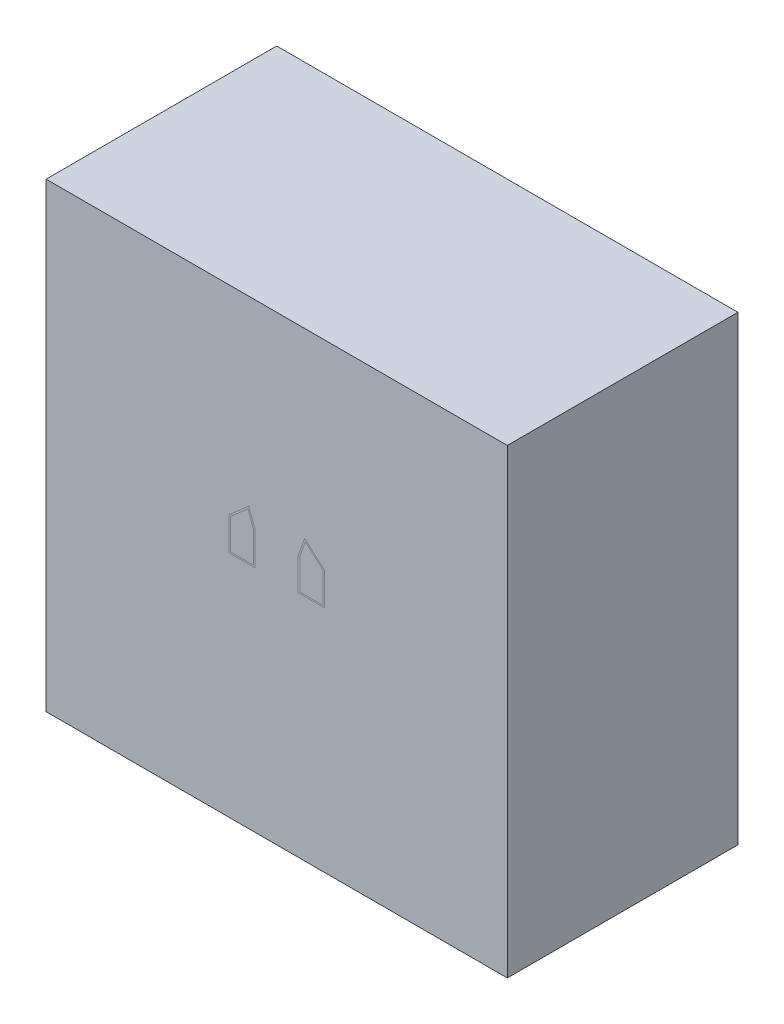
ISO-10303-21;
HEADER;
FILE_DESCRIPTION(('STEP AP214'),'2;1');
FILE_NAME('part.step','',(''),(''),'','','');
FILE_SCHEMA(('AUTOMOTIVE_DESIGN { 1 0 10303 214 1 1 1 1 }'));
ENDSEC;
DATA;
#1=APPLICATION_CONTEXT('core data for automotive mechanical design processes');
#2=APPLICATION_PROTOCOL_DEFINITION('international standard','automotive_design',2000,#1);
#3=PRODUCT_CONTEXT('',#1,'mechanical');
#4=PRODUCT('Part','Part','',(#3));
#5=PRODUCT_RELATED_PRODUCT_CATEGORY('part','',(#4));
#6=PRODUCT_DEFINITION_FORMATION('','',#4);
#7=PRODUCT_DEFINITION_CONTEXT('part definition',#1,'design');
#8=PRODUCT_DEFINITION('design','',#6,#7);
#9=PRODUCT_DEFINITION_SHAPE('','',#8);
#10=(LENGTH_UNIT() NAMED_UNIT(*) SI_UNIT(.MILLI.,.METRE.));
#11=(NAMED_UNIT(*) PLANE_ANGLE_UNIT() SI_UNIT($,.RADIAN.));
#12=(NAMED_UNIT(*) SI_UNIT($,.STERADIAN.) SOLID_ANGLE_UNIT());
#13=UNCERTAINTY_MEASURE_WITH_UNIT(LENGTH_MEASURE(1.E-05),#10,'distance_accuracy_value','');
#14=(GEOMETRIC_REPRESENTATION_CONTEXT(3) GLOBAL_UNCERTAINTY_ASSIGNED_CONTEXT((#13)) GLOBAL_UNIT_ASSIGNED_CONTEXT((#10,
#11,#12)) REPRESENTATION_CONTEXT('',''));
#15=CARTESIAN_POINT('',(0.,0.,0.));
#16=DIRECTION('',(0.,0.,1.));
#17=DIRECTION('',(1.,0.,0.));
#18=AXIS2_PLACEMENT_3D('',#15,#16,#17);
#19=CARTESIAN_POINT('',(0.,201.763269807085,0.));
#20=DIRECTION('',(0.,1.,0.));
#21=DIRECTION('',(0.,0.,1.));
#22=AXIS2_PLACEMENT_3D('',#19,#20,#21);
#23=CONICAL_SURFACE('',#22,140.,0.349065850398862);
#24=DIRECTION('',(-0.342020143325665,0.93969262078591,0.));
#25=VECTOR('',#24,1.);
#26=CARTESIAN_POINT('',(0.,-182.883568916567,0.));
#27=LINE('',#26,#25);
#28=CARTESIAN_POINT('',(-182.009803830833,317.184257228019,0.));
#29=VERTEX_POINT('',#28);
#30=CARTESIAN_POINT('',(-140.,201.763269807085,0.));
#31=VERTEX_POINT('',#30);
#32=EDGE_CURVE('E77',#29,#31,#27,.F.);
#33=ORIENTED_EDGE('',*,*,#32,.F.);
#34=CARTESIAN_POINT('',(0.,317.184257228019,0.));
#35=DIRECTION('',(0.,-1.,0.));
#36=DIRECTION('',(0.,0.,-1.));
#37=AXIS2_PLACEMENT_3D('',#34,#35,#36);
#38=CIRCLE('',#37,182.009803830833);
#39=CARTESIAN_POINT('',(182.009803830833,317.184257228019,0.));
#40=VERTEX_POINT('',#39);
#41=EDGE_CURVE('E176',#29,#40,#38,.T.);
#42=ORIENTED_EDGE('',*,*,#41,.T.);
#43=DIRECTION('',(-0.342020143325665,-0.93969262078591,0.));
#44=VECTOR('',#43,1.);
#45=CARTESIAN_POINT('',(0.,-182.883568916567,0.));
#46=LINE('',#45,#44);
#47=CARTESIAN_POINT('',(140.,201.763269807085,0.));
#48=VERTEX_POINT('',#47);
#49=EDGE_CURVE('E152',#48,#40,#46,.F.);
#50=ORIENTED_EDGE('',*,*,#49,.F.);
#51=CARTESIAN_POINT('',(0.,201.763269807085,0.));
#52=DIRECTION('',(0.,-1.,0.));
#53=DIRECTION('',(0.,0.,-1.));
#54=AXIS2_PLACEMENT_3D('',#51,#52,#53);
#55=CIRCLE('',#54,140.);
#56=EDGE_CURVE('E172',#31,#48,#55,.T.);
#57=ORIENTED_EDGE('',*,*,#56,.F.);
#58=EDGE_LOOP('',(#33,#42,#50,#57));
#59=FACE_BOUND('',#58,.T.);
#60=ADVANCED_FACE('F54',(#59),#23,.T.);
#61=CARTESIAN_POINT('',(0.,204.519783083283,0.));
#62=DIRECTION('',(0.,-1.,0.));
#63=DIRECTION('',(0.,0.,-1.));
#64=AXIS2_PLACEMENT_3D('',#61,#62,#63);
#65=CONICAL_SURFACE('',#64,310.,0.848995740903218);
#66=CARTESIAN_POINT('',(0.,204.519783083283,0.));
#67=DIRECTION('',(0.,-1.,0.));
#68=DIRECTION('',(0.,0.,-1.));
#69=AXIS2_PLACEMENT_3D('',#66,#67,#68);
#70=CIRCLE('',#69,310.);
#71=CARTESIAN_POINT('',(-310.,204.519783083283,0.));
#72=VERTEX_POINT('',#71);
#73=CARTESIAN_POINT('',(310.,204.519783083283,0.));
#74=VERTEX_POINT('',#73);
#75=EDGE_CURVE('E180',#72,#74,#70,.T.);
#76=ORIENTED_EDGE('',*,*,#75,.T.);
#77=DIRECTION('',(0.750617232326963,-0.660737293130795,0.));
#78=VECTOR('',#77,1.);
#79=CARTESIAN_POINT('',(0.,477.399956957741,0.));
#80=LINE('',#79,#78);
#81=EDGE_CURVE('E213',#74,#40,#80,.F.);
#82=ORIENTED_EDGE('',*,*,#81,.T.);
#83=ORIENTED_EDGE('',*,*,#41,.F.);
#84=DIRECTION('',(0.750617232326963,0.660737293130795,0.));
#85=VECTOR('',#84,1.);
#86=CARTESIAN_POINT('',(0.,477.399956957741,0.));
#87=LINE('',#86,#85);
#88=EDGE_CURVE('E222',#29,#72,#87,.F.);
#89=ORIENTED_EDGE('',*,*,#88,.T.);
#90=EDGE_LOOP('',(#76,#82,#83,#89));
#91=FACE_BOUND('',#90,.T.);
#92=ADVANCED_FACE('F249',(#91),#65,.F.);
#93=CARTESIAN_POINT('',(0.,0.,0.));
#94=DIRECTION('',(0.,-1.,0.));
#95=DIRECTION('',(0.,0.,-1.));
#96=AXIS2_PLACEMENT_3D('',#93,#94,#95);
#97=CYLINDRICAL_SURFACE('',#96,310.);
#98=DIRECTION('',(0.,-1.,0.));
#99=VECTOR('',#98,1.);
#100=CARTESIAN_POINT('',(310.,0.,0.));
#101=LINE('',#100,#99);
#102=CARTESIAN_POINT('',(310.,-10.,0.));
#103=VERTEX_POINT('',#102);
#104=EDGE_CURVE('E215',#74,#103,#101,.T.);
#105=ORIENTED_EDGE('',*,*,#104,.F.);
#106=ORIENTED_EDGE('',*,*,#75,.F.);
#107=DIRECTION('',(0.,-1.,0.));
#108=VECTOR('',#107,1.);
#109=CARTESIAN_POINT('',(-310.,0.,0.));
#110=LINE('',#109,#108);
#111=CARTESIAN_POINT('',(-310.,-10.,0.));
#112=VERTEX_POINT('',#111);
#113=EDGE_CURVE('E202',#112,#72,#110,.F.);
#114=ORIENTED_EDGE('',*,*,#113,.F.);
#115=CARTESIAN_POINT('',(0.,-10.,0.));
#116=DIRECTION('',(0.,-1.,0.));
#117=DIRECTION('',(0.,0.,-1.));
#118=AXIS2_PLACEMENT_3D('',#115,#116,#117);
#119=CIRCLE('',#118,310.);
#120=EDGE_CURVE('E184',#112,#103,#119,.T.);
#121=ORIENTED_EDGE('',*,*,#120,.T.);
#122=EDGE_LOOP('',(#105,#106,#114,#121));
#123=FACE_BOUND('',#122,.T.);
#124=ADVANCED_FACE('F253',(#123),#97,.F.);
#125=CARTESIAN_POINT('',(300.,-10.,0.));
#126=DIRECTION('',(0.,1.,0.));
#127=DIRECTION('',(0.,0.,1.));
#128=AXIS2_PLACEMENT_3D('',#125,#126,#127);
#129=PLANE('',#128);
#130=DIRECTION('',(-1.,0.,0.));
#131=VECTOR('',#130,1.);
#132=CARTESIAN_POINT('',(300.,-10.,0.));
#133=LINE('',#132,#131);
#134=CARTESIAN_POINT('',(140.,-10.,0.));
#135=VERTEX_POINT('',#134);
#136=EDGE_CURVE('E204',#103,#135,#133,.T.);
#137=ORIENTED_EDGE('',*,*,#136,.F.);
#138=ORIENTED_EDGE('',*,*,#120,.F.);
#139=CARTESIAN_POINT('',(-140.,-10.,0.));
#140=VERTEX_POINT('',#139);
#141=EDGE_CURVE('E192',#140,#112,#133,.T.);
#142=ORIENTED_EDGE('',*,*,#141,.F.);
#143=CARTESIAN_POINT('',(0.,-10.,0.));
#144=DIRECTION('',(0.,-1.,0.));
#145=DIRECTION('',(0.,0.,-1.));
#146=AXIS2_PLACEMENT_3D('',#143,#144,#145);
#147=CIRCLE('',#146,140.);
#148=EDGE_CURVE('E171',#140,#135,#147,.T.);
#149=ORIENTED_EDGE('',*,*,#148,.T.);
#150=EDGE_LOOP('',(#137,#138,#142,#149));
#151=FACE_BOUND('',#150,.T.);
#152=ADVANCED_FACE('F200',(#151),#129,.T.);
#153=CARTESIAN_POINT('',(0.,0.,0.));
#154=DIRECTION('',(0.,-1.,0.));
#155=DIRECTION('',(0.,0.,-1.));
#156=AXIS2_PLACEMENT_3D('',#153,#154,#155);
#157=CYLINDRICAL_SURFACE('',#156,140.);
#158=DIRECTION('',(0.,-1.,0.));
#159=VECTOR('',#158,1.);
#160=CARTESIAN_POINT('',(140.,0.,0.));
#161=LINE('',#160,#159);
#162=EDGE_CURVE('E12',#135,#48,#161,.F.);
#163=ORIENTED_EDGE('',*,*,#162,.F.);
#164=ORIENTED_EDGE('',*,*,#148,.F.);
#165=DIRECTION('',(0.,-1.,0.));
#166=VECTOR('',#165,1.);
#167=CARTESIAN_POINT('',(-140.,0.,0.));
#168=LINE('',#167,#166);
#169=EDGE_CURVE('E62',#31,#140,#168,.T.);
#170=ORIENTED_EDGE('',*,*,#169,.F.);
#171=ORIENTED_EDGE('',*,*,#56,.T.);
#172=EDGE_LOOP('',(#163,#164,#170,#171));
#173=FACE_BOUND('',#172,.T.);
#174=ADVANCED_FACE('F206',(#173),#157,.T.);
#175=CARTESIAN_POINT('',(-1500.,-1500.,0.));
#176=DIRECTION('',(0.,0.,-1.));
#177=DIRECTION('',(-1.,0.,0.));
#178=AXIS2_PLACEMENT_3D('',#175,#176,#177);
#179=PLANE('',#178);
#180=ORIENTED_EDGE('',*,*,#49,.T.);
#181=ORIENTED_EDGE('',*,*,#81,.F.);
#182=ORIENTED_EDGE('',*,*,#104,.T.);
#183=ORIENTED_EDGE('',*,*,#136,.T.);
#184=ORIENTED_EDGE('',*,*,#162,.T.);
#185=EDGE_LOOP('',(#180,#181,#182,#183,#184));
#186=FACE_BOUND('',#185,.T.);
#187=ORIENTED_EDGE('',*,*,#32,.T.);
#188=ORIENTED_EDGE('',*,*,#169,.T.);
#189=ORIENTED_EDGE('',*,*,#141,.T.);
#190=ORIENTED_EDGE('',*,*,#113,.T.);
#191=ORIENTED_EDGE('',*,*,#88,.F.);
#192=EDGE_LOOP('',(#187,#188,#189,#190,#191));
#193=FACE_BOUND('',#192,.T.);
#194=DIRECTION('',(-1.,0.,0.));
#195=VECTOR('',#194,1.);
#196=CARTESIAN_POINT('',(-1500.,1500.,0.));
#197=LINE('',#196,#195);
#198=CARTESIAN_POINT('',(1500.,1500.,0.));
#199=VERTEX_POINT('',#198);
#200=CARTESIAN_POINT('',(-1500.,1500.,0.));
#201=VERTEX_POINT('',#200);
#202=EDGE_CURVE('E69',#199,#201,#197,.T.);
#203=ORIENTED_EDGE('',*,*,#202,.T.);
#204=DIRECTION('',(0.,1.,0.));
#205=VECTOR('',#204,1.);
#206=CARTESIAN_POINT('',(-1500.,-1500.,0.));
#207=LINE('',#206,#205);
#208=CARTESIAN_POINT('',(-1500.,-1500.,0.));
#209=VERTEX_POINT('',#208);
#210=EDGE_CURVE('E126',#209,#201,#207,.T.);
#211=ORIENTED_EDGE('',*,*,#210,.F.);
#212=DIRECTION('',(-1.,0.,0.));
#213=VECTOR('',#212,1.);
#214=CARTESIAN_POINT('',(-1500.,-1500.,0.));
#215=LINE('',#214,#213);
#216=CARTESIAN_POINT('',(1500.,-1500.,0.));
#217=VERTEX_POINT('',#216);
#218=EDGE_CURVE('E122',#217,#209,#215,.T.);
#219=ORIENTED_EDGE('',*,*,#218,.F.);
#220=DIRECTION('',(0.,1.,0.));
#221=VECTOR('',#220,1.);
#222=CARTESIAN_POINT('',(1500.,-1500.,0.));
#223=LINE('',#222,#221);
#224=EDGE_CURVE('E125',#217,#199,#223,.T.);
#225=ORIENTED_EDGE('',*,*,#224,.T.);
#226=EDGE_LOOP('',(#203,#211,#219,#225));
#227=FACE_BOUND('',#226,.T.);
#228=ADVANCED_FACE('F124',(#186,#193,#227),#179,.F.);
#229=CARTESIAN_POINT('',(1500.,-1500.,1500.));
#230=DIRECTION('',(0.,1.,0.));
#231=DIRECTION('',(0.,0.,1.));
#232=AXIS2_PLACEMENT_3D('',#229,#230,#231);
#233=PLANE('',#232);
#234=DIRECTION('',(0.,0.,-1.));
#235=VECTOR('',#234,1.);
#236=CARTESIAN_POINT('',(1500.,-1500.,1500.));
#237=LINE('',#236,#235);
#238=CARTESIAN_POINT('',(1500.,-1500.,-1500.));
#239=VERTEX_POINT('',#238);
#240=EDGE_CURVE('E136',#217,#239,#237,.T.);
#241=ORIENTED_EDGE('',*,*,#240,.F.);
#242=ORIENTED_EDGE('',*,*,#218,.T.);
#243=DIRECTION('',(0.,0.,-1.));
#244=VECTOR('',#243,1.);
#245=CARTESIAN_POINT('',(-1500.,-1500.,1500.));
#246=LINE('',#245,#244);
#247=CARTESIAN_POINT('',(-1500.,-1500.,-1500.));
#248=VERTEX_POINT('',#247);
#249=EDGE_CURVE('E146',#209,#248,#246,.T.);
#250=ORIENTED_EDGE('',*,*,#249,.T.);
#251=DIRECTION('',(1.,0.,0.));
#252=VECTOR('',#251,1.);
#253=CARTESIAN_POINT('',(1500.,-1500.,-1500.));
#254=LINE('',#253,#252);
#255=EDGE_CURVE('E143',#248,#239,#254,.T.);
#256=ORIENTED_EDGE('',*,*,#255,.T.);
#257=EDGE_LOOP('',(#241,#242,#250,#256));
#258=FACE_BOUND('',#257,.T.);
#259=ADVANCED_FACE('F141',(#258),#233,.F.);
#260=CARTESIAN_POINT('',(1500.,1500.,1500.));
#261=DIRECTION('',(-1.,0.,0.));
#262=DIRECTION('',(0.,-1.,0.));
#263=AXIS2_PLACEMENT_3D('',#260,#261,#262);
#264=PLANE('',#263);
#265=DIRECTION('',(0.,0.,-1.));
#266=VECTOR('',#265,1.);
#267=CARTESIAN_POINT('',(1500.,1500.,1500.));
#268=LINE('',#267,#266);
#269=CARTESIAN_POINT('',(1500.,1500.,-1500.));
#270=VERTEX_POINT('',#269);
#271=EDGE_CURVE('E138',#199,#270,#268,.T.);
#272=ORIENTED_EDGE('',*,*,#271,.F.);
#273=ORIENTED_EDGE('',*,*,#224,.F.);
#274=ORIENTED_EDGE('',*,*,#240,.T.);
#275=DIRECTION('',(0.,1.,0.));
#276=VECTOR('',#275,1.);
#277=CARTESIAN_POINT('',(1500.,1500.,-1500.));
#278=LINE('',#277,#276);
#279=EDGE_CURVE('E166',#239,#270,#278,.T.);
#280=ORIENTED_EDGE('',*,*,#279,.T.);
#281=EDGE_LOOP('',(#272,#273,#274,#280));
#282=FACE_BOUND('',#281,.T.);
#283=ADVANCED_FACE('F134',(#282),#264,.F.);
#284=CARTESIAN_POINT('',(-1500.,1500.,1500.));
#285=DIRECTION('',(0.,-1.,0.));
#286=DIRECTION('',(0.,0.,-1.));
#287=AXIS2_PLACEMENT_3D('',#284,#285,#286);
#288=PLANE('',#287);
#289=DIRECTION('',(0.,0.,-1.));
#290=VECTOR('',#289,1.);
#291=CARTESIAN_POINT('',(-1500.,1500.,1500.));
#292=LINE('',#291,#290);
#293=CARTESIAN_POINT('',(-1500.,1500.,-1500.));
#294=VERTEX_POINT('',#293);
#295=EDGE_CURVE('E150',#201,#294,#292,.T.);
#296=ORIENTED_EDGE('',*,*,#295,.F.);
#297=ORIENTED_EDGE('',*,*,#202,.F.);
#298=ORIENTED_EDGE('',*,*,#271,.T.);
#299=DIRECTION('',(-1.,0.,0.));
#300=VECTOR('',#299,1.);
#301=CARTESIAN_POINT('',(-1500.,1500.,-1500.));
#302=LINE('',#301,#300);
#303=EDGE_CURVE('E162',#270,#294,#302,.T.);
#304=ORIENTED_EDGE('',*,*,#303,.T.);
#305=EDGE_LOOP('',(#296,#297,#298,#304));
#306=FACE_BOUND('',#305,.T.);
#307=ADVANCED_FACE('F236',(#306),#288,.F.);
#308=CARTESIAN_POINT('',(-1500.,-1.83697019872103E-13,1500.));
#309=DIRECTION('',(1.,0.,0.));
#310=DIRECTION('',(0.,0.,-1.));
#311=AXIS2_PLACEMENT_3D('',#308,#309,#310);
#312=PLANE('',#311);
#313=ORIENTED_EDGE('',*,*,#249,.F.);
#314=ORIENTED_EDGE('',*,*,#210,.T.);
#315=ORIENTED_EDGE('',*,*,#295,.T.);
#316=DIRECTION('',(0.,-1.,0.));
#317=VECTOR('',#316,1.);
#318=CARTESIAN_POINT('',(-1500.,-1.83697019872103E-13,-1500.));
#319=LINE('',#318,#317);
#320=EDGE_CURVE('E158',#294,#248,#319,.T.);
#321=ORIENTED_EDGE('',*,*,#320,.T.);
#322=EDGE_LOOP('',(#313,#314,#315,#321));
#323=FACE_BOUND('',#322,.T.);
#324=ADVANCED_FACE('F234',(#323),#312,.F.);
#325=CARTESIAN_POINT('',(0.,0.,-1500.));
#326=DIRECTION('',(0.,0.,-1.));
#327=DIRECTION('',(-1.,0.,0.));
#328=AXIS2_PLACEMENT_3D('',#325,#326,#327);
#329=PLANE('',#328);
#330=ORIENTED_EDGE('',*,*,#255,.F.);
#331=ORIENTED_EDGE('',*,*,#320,.F.);
#332=ORIENTED_EDGE('',*,*,#303,.F.);
#333=ORIENTED_EDGE('',*,*,#279,.F.);
#334=EDGE_LOOP('',(#330,#331,#332,#333));
#335=FACE_BOUND('',#334,.T.);
#336=ADVANCED_FACE('F240',(#335),#329,.T.);
#337=CLOSED_SHELL('',(#60,#92,#124,#152,#174,#228,#259,#283,#307,#324,#336));
#338=MANIFOLD_SOLID_BREP('B2',#337);
#339=CARTESIAN_POINT('',(0.,200.,0.));
#340=DIRECTION('',(0.,1.,0.));
#341=DIRECTION('',(0.,0.,1.));
#342=AXIS2_PLACEMENT_3D('',#339,#340,#341);
#343=CONICAL_SURFACE('',#342,150.,0.349065850398862);
#344=CARTESIAN_POINT('',(0.,300.,0.));
#345=DIRECTION('',(0.,-1.,0.));
#346=DIRECTION('',(0.,0.,-1.));
#347=AXIS2_PLACEMENT_3D('',#344,#345,#346);
#348=CIRCLE('',#347,186.39702342662);
#349=CARTESIAN_POINT('',(-186.39702342662,300.,0.));
#350=VERTEX_POINT('',#349);
#351=CARTESIAN_POINT('',(186.39702342662,300.,0.));
#352=VERTEX_POINT('',#351);
#353=EDGE_CURVE('E427',#350,#352,#348,.T.);
#354=ORIENTED_EDGE('',*,*,#353,.F.);
#355=DIRECTION('',(-0.342020143325665,0.93969262078591,0.));
#356=VECTOR('',#355,1.);
#357=CARTESIAN_POINT('',(0.,-212.121612918198,0.));
#358=LINE('',#357,#356);
#359=CARTESIAN_POINT('',(-150.,200.,0.));
#360=VERTEX_POINT('',#359);
#361=EDGE_CURVE('E415',#350,#360,#358,.F.);
#362=ORIENTED_EDGE('',*,*,#361,.T.);
#363=CARTESIAN_POINT('',(0.,200.,0.));
#364=DIRECTION('',(0.,-1.,0.));
#365=DIRECTION('',(0.,0.,-1.));
#366=AXIS2_PLACEMENT_3D('',#363,#364,#365);
#367=CIRCLE('',#366,150.);
#368=CARTESIAN_POINT('',(150.,200.,0.));
#369=VERTEX_POINT('',#368);
#370=EDGE_CURVE('E425',#360,#369,#367,.T.);
#371=ORIENTED_EDGE('',*,*,#370,.T.);
#372=DIRECTION('',(-0.342020143325665,-0.93969262078591,0.));
#373=VECTOR('',#372,1.);
#374=CARTESIAN_POINT('',(0.,-212.121612918198,0.));
#375=LINE('',#374,#373);
#376=EDGE_CURVE('E385',#369,#352,#375,.F.);
#377=ORIENTED_EDGE('',*,*,#376,.T.);
#378=EDGE_LOOP('',(#354,#362,#371,#377));
#379=FACE_BOUND('',#378,.T.);
#380=ADVANCED_FACE('F370',(#379),#343,.F.);
#381=CARTESIAN_POINT('',(0.,200.,0.));
#382=DIRECTION('',(0.,-1.,0.));
#383=DIRECTION('',(0.,0.,-1.));
#384=AXIS2_PLACEMENT_3D('',#381,#382,#383);
#385=CONICAL_SURFACE('',#384,300.,0.848995740903218);
#386=DIRECTION('',(0.750617232326963,-0.660737293130795,0.));
#387=VECTOR('',#386,1.);
#388=CARTESIAN_POINT('',(0.,464.077587620444,0.));
#389=LINE('',#388,#387);
#390=CARTESIAN_POINT('',(300.,200.,0.));
#391=VERTEX_POINT('',#390);
#392=EDGE_CURVE('E435',#391,#352,#389,.F.);
#393=ORIENTED_EDGE('',*,*,#392,.F.);
#394=CARTESIAN_POINT('',(0.,200.,0.));
#395=DIRECTION('',(0.,-1.,0.));
#396=DIRECTION('',(0.,0.,-1.));
#397=AXIS2_PLACEMENT_3D('',#394,#395,#396);
#398=CIRCLE('',#397,300.);
#399=CARTESIAN_POINT('',(-300.,200.,0.));
#400=VERTEX_POINT('',#399);
#401=EDGE_CURVE('E433',#400,#391,#398,.T.);
#402=ORIENTED_EDGE('',*,*,#401,.F.);
#403=DIRECTION('',(0.750617232326963,0.660737293130795,0.));
#404=VECTOR('',#403,1.);
#405=CARTESIAN_POINT('',(0.,464.077587620444,0.));
#406=LINE('',#405,#404);
#407=EDGE_CURVE('E429',#350,#400,#406,.F.);
#408=ORIENTED_EDGE('',*,*,#407,.F.);
#409=ORIENTED_EDGE('',*,*,#353,.T.);
#410=EDGE_LOOP('',(#393,#402,#408,#409));
#411=FACE_BOUND('',#410,.T.);
#412=ADVANCED_FACE('F461',(#411),#385,.T.);
#413=CARTESIAN_POINT('',(0.,0.,0.));
#414=DIRECTION('',(0.,-1.,0.));
#415=DIRECTION('',(0.,0.,-1.));
#416=AXIS2_PLACEMENT_3D('',#413,#414,#415);
#417=CYLINDRICAL_SURFACE('',#416,300.);
#418=ORIENTED_EDGE('',*,*,#401,.T.);
#419=DIRECTION('',(0.,-1.,0.));
#420=VECTOR('',#419,1.);
#421=CARTESIAN_POINT('',(300.,0.,0.));
#422=LINE('',#421,#420);
#423=CARTESIAN_POINT('',(300.,0.,0.));
#424=VERTEX_POINT('',#423);
#425=EDGE_CURVE('E445',#391,#424,#422,.T.);
#426=ORIENTED_EDGE('',*,*,#425,.T.);
#427=CARTESIAN_POINT('',(0.,0.,0.));
#428=DIRECTION('',(0.,-1.,0.));
#429=DIRECTION('',(0.,0.,-1.));
#430=AXIS2_PLACEMENT_3D('',#427,#428,#429);
#431=CIRCLE('',#430,300.);
#432=CARTESIAN_POINT('',(-300.,0.,0.));
#433=VERTEX_POINT('',#432);
#434=EDGE_CURVE('E440',#433,#424,#431,.T.);
#435=ORIENTED_EDGE('',*,*,#434,.F.);
#436=DIRECTION('',(0.,-1.,0.));
#437=VECTOR('',#436,1.);
#438=CARTESIAN_POINT('',(-300.,0.,0.));
#439=LINE('',#438,#437);
#440=EDGE_CURVE('E449',#433,#400,#439,.F.);
#441=ORIENTED_EDGE('',*,*,#440,.T.);
#442=EDGE_LOOP('',(#418,#426,#435,#441));
#443=FACE_BOUND('',#442,.T.);
#444=ADVANCED_FACE('F458',(#443),#417,.T.);
#445=CARTESIAN_POINT('',(300.,0.,0.));
#446=DIRECTION('',(0.,1.,0.));
#447=DIRECTION('',(0.,0.,1.));
#448=AXIS2_PLACEMENT_3D('',#445,#446,#447);
#449=PLANE('',#448);
#450=ORIENTED_EDGE('',*,*,#434,.T.);
#451=DIRECTION('',(-1.,0.,0.));
#452=VECTOR('',#451,1.);
#453=CARTESIAN_POINT('',(300.,0.,0.));
#454=LINE('',#453,#452);
#455=CARTESIAN_POINT('',(150.,0.,0.));
#456=VERTEX_POINT('',#455);
#457=EDGE_CURVE('E428',#424,#456,#454,.T.);
#458=ORIENTED_EDGE('',*,*,#457,.T.);
#459=CARTESIAN_POINT('',(0.,0.,0.));
#460=DIRECTION('',(0.,-1.,0.));
#461=DIRECTION('',(0.,0.,-1.));
#462=AXIS2_PLACEMENT_3D('',#459,#460,#461);
#463=CIRCLE('',#462,150.);
#464=CARTESIAN_POINT('',(-150.,0.,0.));
#465=VERTEX_POINT('',#464);
#466=EDGE_CURVE('E421',#465,#456,#463,.T.);
#467=ORIENTED_EDGE('',*,*,#466,.F.);
#468=EDGE_CURVE('E392',#465,#433,#454,.T.);
#469=ORIENTED_EDGE('',*,*,#468,.T.);
#470=EDGE_LOOP('',(#450,#458,#467,#469));
#471=FACE_BOUND('',#470,.T.);
#472=ADVANCED_FACE('F372',(#471),#449,.F.);
#473=CARTESIAN_POINT('',(0.,0.,0.));
#474=DIRECTION('',(0.,-1.,0.));
#475=DIRECTION('',(0.,0.,-1.));
#476=AXIS2_PLACEMENT_3D('',#473,#474,#475);
#477=CYLINDRICAL_SURFACE('',#476,150.);
#478=ORIENTED_EDGE('',*,*,#466,.T.);
#479=DIRECTION('',(0.,-1.,0.));
#480=VECTOR('',#479,1.);
#481=CARTESIAN_POINT('',(150.,0.,0.));
#482=LINE('',#481,#480);
#483=EDGE_CURVE('E52',#456,#369,#482,.F.);
#484=ORIENTED_EDGE('',*,*,#483,.T.);
#485=ORIENTED_EDGE('',*,*,#370,.F.);
#486=DIRECTION('',(0.,-1.,0.));
#487=VECTOR('',#486,1.);
#488=CARTESIAN_POINT('',(-150.,0.,0.));
#489=LINE('',#488,#487);
#490=EDGE_CURVE('E378',#360,#465,#489,.T.);
#491=ORIENTED_EDGE('',*,*,#490,.T.);
#492=EDGE_LOOP('',(#478,#484,#485,#491));
#493=FACE_BOUND('',#492,.T.);
#494=ADVANCED_FACE('F431',(#493),#477,.F.);
#495=CARTESIAN_POINT('',(-1500.,-1500.,0.));
#496=DIRECTION('',(0.,0.,-1.));
#497=DIRECTION('',(-1.,0.,0.));
#498=AXIS2_PLACEMENT_3D('',#495,#496,#497);
#499=PLANE('',#498);
#500=ORIENTED_EDGE('',*,*,#407,.T.);
#501=ORIENTED_EDGE('',*,*,#440,.F.);
#502=ORIENTED_EDGE('',*,*,#468,.F.);
#503=ORIENTED_EDGE('',*,*,#490,.F.);
#504=ORIENTED_EDGE('',*,*,#361,.F.);
#505=EDGE_LOOP('',(#500,#501,#502,#503,#504));
#506=FACE_BOUND('',#505,.T.);
#507=ADVANCED_FACE('F414',(#506),#499,.F.);
#508=ORIENTED_EDGE('',*,*,#483,.F.);
#509=ORIENTED_EDGE('',*,*,#457,.F.);
#510=ORIENTED_EDGE('',*,*,#425,.F.);
#511=ORIENTED_EDGE('',*,*,#392,.T.);
#512=ORIENTED_EDGE('',*,*,#376,.F.);
#513=EDGE_LOOP('',(#508,#509,#510,#511,#512));
#514=FACE_BOUND('',#513,.T.);
#515=ADVANCED_FACE('F455',(#514),#499,.F.);
#516=CLOSED_SHELL('',(#380,#412,#444,#472,#494,#507,#515));
#517=MANIFOLD_SOLID_BREP('B6',#516);
#518=CARTESIAN_POINT('',(0.,200.,0.));
#519=DIRECTION('',(0.,1.,0.));
#520=DIRECTION('',(0.,0.,1.));
#521=AXIS2_PLACEMENT_3D('',#518,#519,#520);
#522=CONICAL_SURFACE('',#521,150.,0.349065850398862);
#523=DIRECTION('',(-0.342020143325665,0.93969262078591,0.));
#524=VECTOR('',#523,1.);
#525=CARTESIAN_POINT('',(0.,-212.121612918198,0.));
#526=LINE('',#525,#524);
#527=CARTESIAN_POINT('',(-186.39702342662,300.,0.));
#528=VERTEX_POINT('',#527);
#529=CARTESIAN_POINT('',(-150.,200.,0.));
#530=VERTEX_POINT('',#529);
#531=EDGE_CURVE('E611',#528,#530,#526,.F.);
#532=ORIENTED_EDGE('',*,*,#531,.F.);
#533=CARTESIAN_POINT('',(0.,300.,0.));
#534=DIRECTION('',(0.,-1.,0.));
#535=DIRECTION('',(0.,0.,-1.));
#536=AXIS2_PLACEMENT_3D('',#533,#534,#535);
#537=CIRCLE('',#536,186.39702342662);
#538=CARTESIAN_POINT('',(186.39702342662,300.,0.));
#539=VERTEX_POINT('',#538);
#540=EDGE_CURVE('E638',#528,#539,#537,.T.);
#541=ORIENTED_EDGE('',*,*,#540,.T.);
#542=DIRECTION('',(-0.342020143325665,-0.93969262078591,0.));
#543=VECTOR('',#542,1.);
#544=CARTESIAN_POINT('',(0.,-212.121612918198,0.));
#545=LINE('',#544,#543);
#546=CARTESIAN_POINT('',(150.,200.,0.));
#547=VERTEX_POINT('',#546);
#548=EDGE_CURVE('E684',#547,#539,#545,.F.);
#549=ORIENTED_EDGE('',*,*,#548,.F.);
#550=CARTESIAN_POINT('',(0.,200.,0.));
#551=DIRECTION('',(0.,-1.,0.));
#552=DIRECTION('',(0.,0.,-1.));
#553=AXIS2_PLACEMENT_3D('',#550,#551,#552);
#554=CIRCLE('',#553,150.);
#555=EDGE_CURVE('E641',#530,#547,#554,.T.);
#556=ORIENTED_EDGE('',*,*,#555,.F.);
#557=EDGE_LOOP('',(#532,#541,#549,#556));
#558=FACE_BOUND('',#557,.T.);
#559=ADVANCED_FACE('F532',(#558),#522,.T.);
#560=CARTESIAN_POINT('',(0.,200.,0.));
#561=DIRECTION('',(0.,-1.,0.));
#562=DIRECTION('',(0.,0.,-1.));
#563=AXIS2_PLACEMENT_3D('',#560,#561,#562);
#564=CONICAL_SURFACE('',#563,300.,0.848995740903218);
#565=CARTESIAN_POINT('',(0.,200.,0.));
#566=DIRECTION('',(0.,-1.,0.));
#567=DIRECTION('',(0.,0.,-1.));
#568=AXIS2_PLACEMENT_3D('',#565,#566,#567);
#569=CIRCLE('',#568,300.);
#570=CARTESIAN_POINT('',(-300.,200.,0.));
#571=VERTEX_POINT('',#570);
#572=CARTESIAN_POINT('',(300.,200.,0.));
#573=VERTEX_POINT('',#572);
#574=EDGE_CURVE('E630',#571,#573,#569,.T.);
#575=ORIENTED_EDGE('',*,*,#574,.T.);
#576=DIRECTION('',(0.750617232326963,-0.660737293130795,0.));
#577=VECTOR('',#576,1.);
#578=CARTESIAN_POINT('',(0.,464.077587620444,0.));
#579=LINE('',#578,#577);
#580=EDGE_CURVE('E686',#573,#539,#579,.F.);
#581=ORIENTED_EDGE('',*,*,#580,.T.);
#582=ORIENTED_EDGE('',*,*,#540,.F.);
#583=DIRECTION('',(0.750617232326963,0.660737293130795,0.));
#584=VECTOR('',#583,1.);
#585=CARTESIAN_POINT('',(0.,464.077587620444,0.));
#586=LINE('',#585,#584);
#587=EDGE_CURVE('E692',#528,#571,#586,.F.);
#588=ORIENTED_EDGE('',*,*,#587,.T.);
#589=EDGE_LOOP('',(#575,#581,#582,#588));
#590=FACE_BOUND('',#589,.T.);
#591=ADVANCED_FACE('F699',(#590),#564,.F.);
#592=CARTESIAN_POINT('',(0.,0.,0.));
#593=DIRECTION('',(0.,-1.,0.));
#594=DIRECTION('',(0.,0.,-1.));
#595=AXIS2_PLACEMENT_3D('',#592,#593,#594);
#596=CYLINDRICAL_SURFACE('',#595,300.);
#597=DIRECTION('',(0.,-1.,0.));
#598=VECTOR('',#597,1.);
#599=CARTESIAN_POINT('',(300.,0.,0.));
#600=LINE('',#599,#598);
#601=CARTESIAN_POINT('',(300.,0.,0.));
#602=VERTEX_POINT('',#601);
#603=EDGE_CURVE('E689',#573,#602,#600,.T.);
#604=ORIENTED_EDGE('',*,*,#603,.F.);
#605=ORIENTED_EDGE('',*,*,#574,.F.);
#606=DIRECTION('',(0.,-1.,0.));
#607=VECTOR('',#606,1.);
#608=CARTESIAN_POINT('',(-300.,0.,0.));
#609=LINE('',#608,#607);
#610=CARTESIAN_POINT('',(-300.,0.,0.));
#611=VERTEX_POINT('',#610);
#612=EDGE_CURVE('E624',#611,#571,#609,.F.);
#613=ORIENTED_EDGE('',*,*,#612,.F.);
#614=CARTESIAN_POINT('',(0.,0.,0.));
#615=DIRECTION('',(0.,-1.,0.));
#616=DIRECTION('',(0.,0.,-1.));
#617=AXIS2_PLACEMENT_3D('',#614,#615,#616);
#618=CIRCLE('',#617,300.);
#619=EDGE_CURVE('E623',#611,#602,#618,.T.);
#620=ORIENTED_EDGE('',*,*,#619,.T.);
#621=EDGE_LOOP('',(#604,#605,#613,#620));
#622=FACE_BOUND('',#621,.T.);
#623=ADVANCED_FACE('F701',(#622),#596,.F.);
#624=CARTESIAN_POINT('',(300.,0.,0.));
#625=DIRECTION('',(0.,1.,0.));
#626=DIRECTION('',(0.,0.,1.));
#627=AXIS2_PLACEMENT_3D('',#624,#625,#626);
#628=PLANE('',#627);
#629=DIRECTION('',(-1.,0.,0.));
#630=VECTOR('',#629,1.);
#631=CARTESIAN_POINT('',(300.,0.,0.));
#632=LINE('',#631,#630);
#633=CARTESIAN_POINT('',(150.,0.,0.));
#634=VERTEX_POINT('',#633);
#635=EDGE_CURVE('E626',#602,#634,#632,.T.);
#636=ORIENTED_EDGE('',*,*,#635,.F.);
#637=ORIENTED_EDGE('',*,*,#619,.F.);
#638=CARTESIAN_POINT('',(-150.,0.,0.));
#639=VERTEX_POINT('',#638);
#640=EDGE_CURVE('E608',#639,#611,#632,.T.);
#641=ORIENTED_EDGE('',*,*,#640,.F.);
#642=CARTESIAN_POINT('',(0.,0.,0.));
#643=DIRECTION('',(0.,-1.,0.));
#644=DIRECTION('',(0.,0.,-1.));
#645=AXIS2_PLACEMENT_3D('',#642,#643,#644);
#646=CIRCLE('',#645,150.);
#647=EDGE_CURVE('E616',#639,#634,#646,.T.);
#648=ORIENTED_EDGE('',*,*,#647,.T.);
#649=EDGE_LOOP('',(#636,#637,#641,#648));
#650=FACE_BOUND('',#649,.T.);
#651=ADVANCED_FACE('F621',(#650),#628,.T.);
#652=CARTESIAN_POINT('',(0.,0.,0.));
#653=DIRECTION('',(0.,-1.,0.));
#654=DIRECTION('',(0.,0.,-1.));
#655=AXIS2_PLACEMENT_3D('',#652,#653,#654);
#656=CYLINDRICAL_SURFACE('',#655,150.);
#657=DIRECTION('',(0.,-1.,0.));
#658=VECTOR('',#657,1.);
#659=CARTESIAN_POINT('',(150.,0.,0.));
#660=LINE('',#659,#658);
#661=EDGE_CURVE('E368',#634,#547,#660,.F.);
#662=ORIENTED_EDGE('',*,*,#661,.F.);
#663=ORIENTED_EDGE('',*,*,#647,.F.);
#664=DIRECTION('',(0.,-1.,0.));
#665=VECTOR('',#664,1.);
#666=CARTESIAN_POINT('',(-150.,0.,0.));
#667=LINE('',#666,#665);
#668=EDGE_CURVE('E539',#530,#639,#667,.T.);
#669=ORIENTED_EDGE('',*,*,#668,.F.);
#670=ORIENTED_EDGE('',*,*,#555,.T.);
#671=EDGE_LOOP('',(#662,#663,#669,#670));
#672=FACE_BOUND('',#671,.T.);
#673=ADVANCED_FACE('F628',(#672),#656,.T.);
#674=CARTESIAN_POINT('',(-1500.,-1500.,0.));
#675=DIRECTION('',(0.,0.,-1.));
#676=DIRECTION('',(-1.,0.,0.));
#677=AXIS2_PLACEMENT_3D('',#674,#675,#676);
#678=PLANE('',#677);
#679=ORIENTED_EDGE('',*,*,#531,.T.);
#680=ORIENTED_EDGE('',*,*,#668,.T.);
#681=ORIENTED_EDGE('',*,*,#640,.T.);
#682=ORIENTED_EDGE('',*,*,#612,.T.);
#683=ORIENTED_EDGE('',*,*,#587,.F.);
#684=EDGE_LOOP('',(#679,#680,#681,#682,#683));
#685=FACE_BOUND('',#684,.T.);
#686=DIRECTION('',(0.750617232326963,0.660737293130795,0.));
#687=VECTOR('',#686,1.);
#688=CARTESIAN_POINT('',(0.,477.399956957741,0.));
#689=LINE('',#688,#687);
#690=CARTESIAN_POINT('',(-182.009803830833,317.184257228019,0.));
#691=VERTEX_POINT('',#690);
#692=CARTESIAN_POINT('',(-310.,204.519783083283,0.));
#693=VERTEX_POINT('',#692);
#694=EDGE_CURVE('E676',#691,#693,#689,.F.);
#695=ORIENTED_EDGE('',*,*,#694,.T.);
#696=DIRECTION('',(0.,-1.,0.));
#697=VECTOR('',#696,1.);
#698=CARTESIAN_POINT('',(-310.,0.,0.));
#699=LINE('',#698,#697);
#700=CARTESIAN_POINT('',(-310.,-10.,0.));
#701=VERTEX_POINT('',#700);
#702=EDGE_CURVE('E678',#701,#693,#699,.F.);
#703=ORIENTED_EDGE('',*,*,#702,.F.);
#704=DIRECTION('',(-1.,0.,0.));
#705=VECTOR('',#704,1.);
#706=CARTESIAN_POINT('',(300.,-10.,0.));
#707=LINE('',#706,#705);
#708=CARTESIAN_POINT('',(-140.,-10.,0.));
#709=VERTEX_POINT('',#708);
#710=EDGE_CURVE('E546',#709,#701,#707,.T.);
#711=ORIENTED_EDGE('',*,*,#710,.F.);
#712=DIRECTION('',(0.,-1.,0.));
#713=VECTOR('',#712,1.);
#714=CARTESIAN_POINT('',(-140.,0.,0.));
#715=LINE('',#714,#713);
#716=CARTESIAN_POINT('',(-140.,201.763269807085,0.));
#717=VERTEX_POINT('',#716);
#718=EDGE_CURVE('E682',#717,#709,#715,.T.);
#719=ORIENTED_EDGE('',*,*,#718,.F.);
#720=DIRECTION('',(-0.342020143325665,0.93969262078591,0.));
#721=VECTOR('',#720,1.);
#722=CARTESIAN_POINT('',(0.,-182.883568916567,0.));
#723=LINE('',#722,#721);
#724=EDGE_CURVE('E674',#691,#717,#723,.F.);
#725=ORIENTED_EDGE('',*,*,#724,.F.);
#726=EDGE_LOOP('',(#695,#703,#711,#719,#725));
#727=FACE_BOUND('',#726,.T.);
#728=ADVANCED_FACE('F607',(#685,#727),#678,.F.);
#729=ORIENTED_EDGE('',*,*,#548,.T.);
#730=ORIENTED_EDGE('',*,*,#580,.F.);
#731=ORIENTED_EDGE('',*,*,#603,.T.);
#732=ORIENTED_EDGE('',*,*,#635,.T.);
#733=ORIENTED_EDGE('',*,*,#661,.T.);
#734=EDGE_LOOP('',(#729,#730,#731,#732,#733));
#735=FACE_BOUND('',#734,.T.);
#736=DIRECTION('',(0.,-1.,0.));
#737=VECTOR('',#736,1.);
#738=CARTESIAN_POINT('',(140.,0.,0.));
#739=LINE('',#738,#737);
#740=CARTESIAN_POINT('',(140.,-10.,0.));
#741=VERTEX_POINT('',#740);
#742=CARTESIAN_POINT('',(140.,201.763269807085,0.));
#743=VERTEX_POINT('',#742);
#744=EDGE_CURVE('E672',#741,#743,#739,.F.);
#745=ORIENTED_EDGE('',*,*,#744,.F.);
#746=CARTESIAN_POINT('',(310.,-10.,0.));
#747=VERTEX_POINT('',#746);
#748=EDGE_CURVE('E669',#747,#741,#707,.T.);
#749=ORIENTED_EDGE('',*,*,#748,.F.);
#750=DIRECTION('',(0.,-1.,0.));
#751=VECTOR('',#750,1.);
#752=CARTESIAN_POINT('',(310.,0.,0.));
#753=LINE('',#752,#751);
#754=CARTESIAN_POINT('',(310.,204.519783083283,0.));
#755=VERTEX_POINT('',#754);
#756=EDGE_CURVE('E666',#755,#747,#753,.T.);
#757=ORIENTED_EDGE('',*,*,#756,.F.);
#758=DIRECTION('',(0.750617232326963,-0.660737293130795,0.));
#759=VECTOR('',#758,1.);
#760=CARTESIAN_POINT('',(0.,477.399956957741,0.));
#761=LINE('',#760,#759);
#762=CARTESIAN_POINT('',(182.009803830833,317.184257228019,0.));
#763=VERTEX_POINT('',#762);
#764=EDGE_CURVE('E664',#755,#763,#761,.F.);
#765=ORIENTED_EDGE('',*,*,#764,.T.);
#766=DIRECTION('',(-0.342020143325665,-0.93969262078591,0.));
#767=VECTOR('',#766,1.);
#768=CARTESIAN_POINT('',(0.,-182.883568916567,0.));
#769=LINE('',#768,#767);
#770=EDGE_CURVE('E554',#743,#763,#769,.F.);
#771=ORIENTED_EDGE('',*,*,#770,.F.);
#772=EDGE_LOOP('',(#745,#749,#757,#765,#771));
#773=FACE_BOUND('',#772,.T.);
#774=ADVANCED_FACE('F703',(#735,#773),#678,.F.);
#775=CARTESIAN_POINT('',(0.,201.763269807085,0.));
#776=DIRECTION('',(0.,1.,0.));
#777=DIRECTION('',(0.,0.,1.));
#778=AXIS2_PLACEMENT_3D('',#775,#776,#777);
#779=CONICAL_SURFACE('',#778,140.,0.349065850398862);
#780=CARTESIAN_POINT('',(0.,317.184257228019,0.));
#781=DIRECTION('',(0.,-1.,0.));
#782=DIRECTION('',(0.,0.,-1.));
#783=AXIS2_PLACEMENT_3D('',#780,#781,#782);
#784=CIRCLE('',#783,182.009803830833);
#785=EDGE_CURVE('E644',#691,#763,#784,.T.);
#786=ORIENTED_EDGE('',*,*,#785,.F.);
#787=ORIENTED_EDGE('',*,*,#724,.T.);
#788=CARTESIAN_POINT('',(0.,201.763269807085,0.));
#789=DIRECTION('',(0.,-1.,0.));
#790=DIRECTION('',(0.,0.,-1.));
#791=AXIS2_PLACEMENT_3D('',#788,#789,#790);
#792=CIRCLE('',#791,140.);
#793=EDGE_CURVE('E642',#717,#743,#792,.T.);
#794=ORIENTED_EDGE('',*,*,#793,.T.);
#795=ORIENTED_EDGE('',*,*,#770,.T.);
#796=EDGE_LOOP('',(#786,#787,#794,#795));
#797=FACE_BOUND('',#796,.T.);
#798=ADVANCED_FACE('F732',(#797),#779,.F.);
#799=CARTESIAN_POINT('',(0.,204.519783083283,0.));
#800=DIRECTION('',(0.,-1.,0.));
#801=DIRECTION('',(0.,0.,-1.));
#802=AXIS2_PLACEMENT_3D('',#799,#800,#801);
#803=CONICAL_SURFACE('',#802,310.,0.848995740903218);
#804=ORIENTED_EDGE('',*,*,#764,.F.);
#805=CARTESIAN_POINT('',(0.,204.519783083283,0.));
#806=DIRECTION('',(0.,-1.,0.));
#807=DIRECTION('',(0.,0.,-1.));
#808=AXIS2_PLACEMENT_3D('',#805,#806,#807);
#809=CIRCLE('',#808,310.);
#810=EDGE_CURVE('E650',#693,#755,#809,.T.);
#811=ORIENTED_EDGE('',*,*,#810,.F.);
#812=ORIENTED_EDGE('',*,*,#694,.F.);
#813=ORIENTED_EDGE('',*,*,#785,.T.);
#814=EDGE_LOOP('',(#804,#811,#812,#813));
#815=FACE_BOUND('',#814,.T.);
#816=ADVANCED_FACE('F728',(#815),#803,.T.);
#817=CARTESIAN_POINT('',(0.,0.,0.));
#818=DIRECTION('',(0.,-1.,0.));
#819=DIRECTION('',(0.,0.,-1.));
#820=AXIS2_PLACEMENT_3D('',#817,#818,#819);
#821=CYLINDRICAL_SURFACE('',#820,310.);
#822=ORIENTED_EDGE('',*,*,#810,.T.);
#823=ORIENTED_EDGE('',*,*,#756,.T.);
#824=CARTESIAN_POINT('',(0.,-10.,0.));
#825=DIRECTION('',(0.,-1.,0.));
#826=DIRECTION('',(0.,0.,-1.));
#827=AXIS2_PLACEMENT_3D('',#824,#825,#826);
#828=CIRCLE('',#827,310.);
#829=EDGE_CURVE('E656',#701,#747,#828,.T.);
#830=ORIENTED_EDGE('',*,*,#829,.F.);
#831=ORIENTED_EDGE('',*,*,#702,.T.);
#832=EDGE_LOOP('',(#822,#823,#830,#831));
#833=FACE_BOUND('',#832,.T.);
#834=ADVANCED_FACE('F725',(#833),#821,.T.);
#835=CARTESIAN_POINT('',(300.,-10.,0.));
#836=DIRECTION('',(0.,1.,0.));
#837=DIRECTION('',(0.,0.,1.));
#838=AXIS2_PLACEMENT_3D('',#835,#836,#837);
#839=PLANE('',#838);
#840=ORIENTED_EDGE('',*,*,#829,.T.);
#841=ORIENTED_EDGE('',*,*,#748,.T.);
#842=CARTESIAN_POINT('',(0.,-10.,0.));
#843=DIRECTION('',(0.,-1.,0.));
#844=DIRECTION('',(0.,0.,-1.));
#845=AXIS2_PLACEMENT_3D('',#842,#843,#844);
#846=CIRCLE('',#845,140.);
#847=EDGE_CURVE('E633',#709,#741,#846,.T.);
#848=ORIENTED_EDGE('',*,*,#847,.F.);
#849=ORIENTED_EDGE('',*,*,#710,.T.);
#850=EDGE_LOOP('',(#840,#841,#848,#849));
#851=FACE_BOUND('',#850,.T.);
#852=ADVANCED_FACE('F722',(#851),#839,.F.);
#853=CARTESIAN_POINT('',(0.,0.,0.));
#854=DIRECTION('',(0.,-1.,0.));
#855=DIRECTION('',(0.,0.,-1.));
#856=AXIS2_PLACEMENT_3D('',#853,#854,#855);
#857=CYLINDRICAL_SURFACE('',#856,140.);
#858=ORIENTED_EDGE('',*,*,#847,.T.);
#859=ORIENTED_EDGE('',*,*,#744,.T.);
#860=ORIENTED_EDGE('',*,*,#793,.F.);
#861=ORIENTED_EDGE('',*,*,#718,.T.);
#862=EDGE_LOOP('',(#858,#859,#860,#861));
#863=FACE_BOUND('',#862,.T.);
#864=ADVANCED_FACE('F719',(#863),#857,.F.);
#865=CLOSED_SHELL('',(#559,#591,#623,#651,#673,#728,#774,#798,#816,#834,#852,#864));
#866=MANIFOLD_SOLID_BREP('B46',#865);
#867=ADVANCED_BREP_SHAPE_REPRESENTATION('',(#18,#338,#517,#866),#14);
#868=SHAPE_DEFINITION_REPRESENTATION(#9,#867);
ENDSEC;
END-ISO-10303-21;
